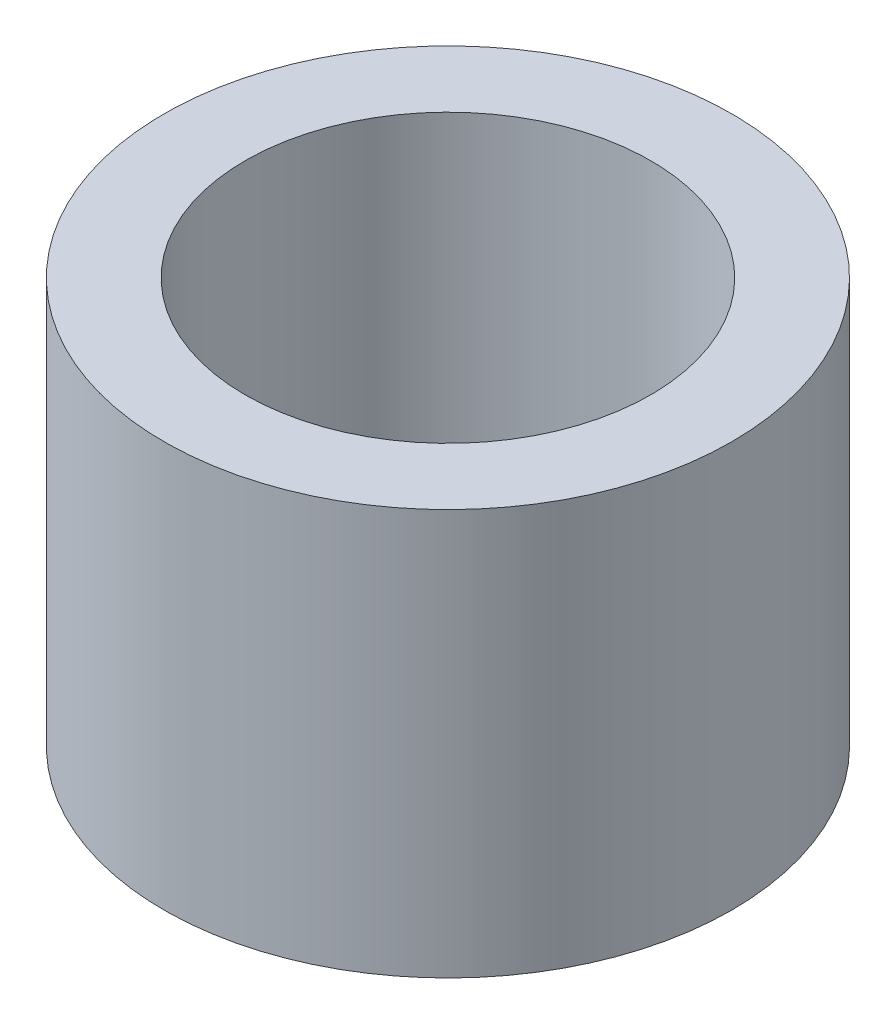
ISO-10303-21;
HEADER;
FILE_DESCRIPTION(('STEP AP214'),'2;1');
FILE_NAME('part.step','',(''),(''),'','','');
FILE_SCHEMA(('AUTOMOTIVE_DESIGN { 1 0 10303 214 1 1 1 1 }'));
ENDSEC;
DATA;
#1=APPLICATION_CONTEXT('core data for automotive mechanical design processes');
#2=APPLICATION_PROTOCOL_DEFINITION('international standard','automotive_design',2000,#1);
#3=PRODUCT_CONTEXT('',#1,'mechanical');
#4=PRODUCT('Part','Part','',(#3));
#5=PRODUCT_RELATED_PRODUCT_CATEGORY('part','',(#4));
#6=PRODUCT_DEFINITION_FORMATION('','',#4);
#7=PRODUCT_DEFINITION_CONTEXT('part definition',#1,'design');
#8=PRODUCT_DEFINITION('design','',#6,#7);
#9=PRODUCT_DEFINITION_SHAPE('','',#8);
#10=(LENGTH_UNIT() NAMED_UNIT(*) SI_UNIT(.MILLI.,.METRE.));
#11=(NAMED_UNIT(*) PLANE_ANGLE_UNIT() SI_UNIT($,.RADIAN.));
#12=(NAMED_UNIT(*) SI_UNIT($,.STERADIAN.) SOLID_ANGLE_UNIT());
#13=UNCERTAINTY_MEASURE_WITH_UNIT(LENGTH_MEASURE(1.E-05),#10,'distance_accuracy_value','');
#14=(GEOMETRIC_REPRESENTATION_CONTEXT(3) GLOBAL_UNCERTAINTY_ASSIGNED_CONTEXT((#13)) GLOBAL_UNIT_ASSIGNED_CONTEXT((#10,
#11,#12)) REPRESENTATION_CONTEXT('',''));
#15=CARTESIAN_POINT('',(0.,0.,0.));
#16=DIRECTION('',(0.,0.,1.));
#17=DIRECTION('',(1.,0.,0.));
#18=AXIS2_PLACEMENT_3D('',#15,#16,#17);
#19=CARTESIAN_POINT('',(0.,50.,0.));
#20=DIRECTION('',(0.,1.,0.));
#21=DIRECTION('',(0.,0.,1.));
#22=AXIS2_PLACEMENT_3D('',#19,#20,#21);
#23=PLANE('',#22);
#24=CARTESIAN_POINT('',(0.,50.,0.));
#25=DIRECTION('',(0.,1.,0.));
#26=DIRECTION('',(1.,0.,0.));
#27=AXIS2_PLACEMENT_3D('',#24,#25,#26);
#28=CIRCLE('',#27,35.);
#29=CARTESIAN_POINT('',(35.,50.,0.));
#30=VERTEX_POINT('',#29);
#31=EDGE_CURVE('E11',#30,#30,#28,.T.);
#32=ORIENTED_EDGE('',*,*,#31,.T.);
#33=EDGE_LOOP('',(#32));
#34=FACE_BOUND('',#33,.T.);
#35=CARTESIAN_POINT('',(0.,50.,0.));
#36=DIRECTION('',(0.,1.,0.));
#37=DIRECTION('',(0.,0.,1.));
#38=AXIS2_PLACEMENT_3D('',#35,#36,#37);
#39=CIRCLE('',#38,25.);
#40=CARTESIAN_POINT('',(0.,50.,25.));
#41=VERTEX_POINT('',#40);
#42=EDGE_CURVE('E49',#41,#41,#39,.T.);
#43=ORIENTED_EDGE('',*,*,#42,.F.);
#44=EDGE_LOOP('',(#43));
#45=FACE_BOUND('',#44,.T.);
#46=ADVANCED_FACE('F38',(#34,#45),#23,.T.);
#47=CARTESIAN_POINT('',(0.,0.,0.));
#48=DIRECTION('',(0.,1.,0.));
#49=DIRECTION('',(0.,0.,1.));
#50=AXIS2_PLACEMENT_3D('',#47,#48,#49);
#51=PLANE('',#50);
#52=CARTESIAN_POINT('',(0.,0.,0.));
#53=DIRECTION('',(0.,1.,0.));
#54=DIRECTION('',(1.,0.,0.));
#55=AXIS2_PLACEMENT_3D('',#52,#53,#54);
#56=CIRCLE('',#55,35.);
#57=CARTESIAN_POINT('',(35.,0.,0.));
#58=VERTEX_POINT('',#57);
#59=EDGE_CURVE('E42',#58,#58,#56,.T.);
#60=ORIENTED_EDGE('',*,*,#59,.F.);
#61=EDGE_LOOP('',(#60));
#62=FACE_BOUND('',#61,.T.);
#63=CARTESIAN_POINT('',(0.,0.,0.));
#64=DIRECTION('',(0.,1.,0.));
#65=DIRECTION('',(0.,0.,1.));
#66=AXIS2_PLACEMENT_3D('',#63,#64,#65);
#67=CIRCLE('',#66,25.);
#68=CARTESIAN_POINT('',(0.,0.,25.));
#69=VERTEX_POINT('',#68);
#70=EDGE_CURVE('E51',#69,#69,#67,.T.);
#71=ORIENTED_EDGE('',*,*,#70,.T.);
#72=EDGE_LOOP('',(#71));
#73=FACE_BOUND('',#72,.T.);
#74=ADVANCED_FACE('F61',(#62,#73),#51,.F.);
#75=CARTESIAN_POINT('',(0.,50.,0.));
#76=DIRECTION('',(0.,-1.,0.));
#77=DIRECTION('',(0.,0.,-1.));
#78=AXIS2_PLACEMENT_3D('',#75,#76,#77);
#79=CYLINDRICAL_SURFACE('',#78,35.);
#80=ORIENTED_EDGE('',*,*,#31,.F.);
#81=EDGE_LOOP('',(#80));
#82=FACE_BOUND('',#81,.T.);
#83=ORIENTED_EDGE('',*,*,#59,.T.);
#84=EDGE_LOOP('',(#83));
#85=FACE_BOUND('',#84,.T.);
#86=ADVANCED_FACE('F40',(#82,#85),#79,.T.);
#87=CARTESIAN_POINT('',(0.,50.,0.));
#88=DIRECTION('',(0.,-1.,0.));
#89=DIRECTION('',(0.,0.,-1.));
#90=AXIS2_PLACEMENT_3D('',#87,#88,#89);
#91=CYLINDRICAL_SURFACE('',#90,25.);
#92=ORIENTED_EDGE('',*,*,#42,.T.);
#93=EDGE_LOOP('',(#92));
#94=FACE_BOUND('',#93,.T.);
#95=ORIENTED_EDGE('',*,*,#70,.F.);
#96=EDGE_LOOP('',(#95));
#97=FACE_BOUND('',#96,.T.);
#98=ADVANCED_FACE('F57',(#94,#97),#91,.F.);
#99=CLOSED_SHELL('',(#46,#74,#86,#98));
#100=MANIFOLD_SOLID_BREP('B2',#99);
#101=ADVANCED_BREP_SHAPE_REPRESENTATION('',(#18,#100),#14);
#102=SHAPE_DEFINITION_REPRESENTATION(#9,#101);
ENDSEC;
END-ISO-10303-21;
